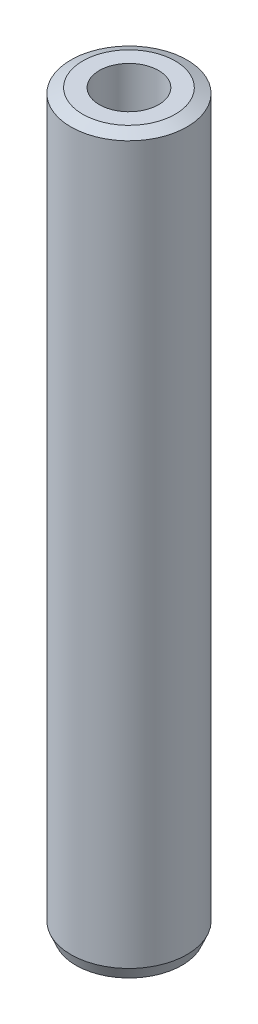
ISO-10303-21;
HEADER;
FILE_DESCRIPTION(('STEP AP214'),'2;1');
FILE_NAME('part.step','',(''),(''),'','','');
FILE_SCHEMA(('AUTOMOTIVE_DESIGN { 1 0 10303 214 1 1 1 1 }'));
ENDSEC;
DATA;
#1=APPLICATION_CONTEXT('core data for automotive mechanical design processes');
#2=APPLICATION_PROTOCOL_DEFINITION('international standard','automotive_design',2000,#1);
#3=PRODUCT_CONTEXT('',#1,'mechanical');
#4=PRODUCT('Part','Part','',(#3));
#5=PRODUCT_RELATED_PRODUCT_CATEGORY('part','',(#4));
#6=PRODUCT_DEFINITION_FORMATION('','',#4);
#7=PRODUCT_DEFINITION_CONTEXT('part definition',#1,'design');
#8=PRODUCT_DEFINITION('design','',#6,#7);
#9=PRODUCT_DEFINITION_SHAPE('','',#8);
#10=(LENGTH_UNIT() NAMED_UNIT(*) SI_UNIT(.MILLI.,.METRE.));
#11=(NAMED_UNIT(*) PLANE_ANGLE_UNIT() SI_UNIT($,.RADIAN.));
#12=(NAMED_UNIT(*) SI_UNIT($,.STERADIAN.) SOLID_ANGLE_UNIT());
#13=UNCERTAINTY_MEASURE_WITH_UNIT(LENGTH_MEASURE(1.E-05),#10,'distance_accuracy_value','');
#14=(GEOMETRIC_REPRESENTATION_CONTEXT(3) GLOBAL_UNCERTAINTY_ASSIGNED_CONTEXT((#13)) GLOBAL_UNIT_ASSIGNED_CONTEXT((#10,
#11,#12)) REPRESENTATION_CONTEXT('',''));
#15=CARTESIAN_POINT('',(0.,0.,0.));
#16=DIRECTION('',(0.,0.,1.));
#17=DIRECTION('',(1.,0.,0.));
#18=AXIS2_PLACEMENT_3D('',#15,#16,#17);
#19=CARTESIAN_POINT('',(0.,600.,0.));
#20=DIRECTION('',(0.,-1.,0.));
#21=DIRECTION('',(0.,0.,-1.));
#22=AXIS2_PLACEMENT_3D('',#19,#20,#21);
#23=CYLINDRICAL_SURFACE('',#22,47.5);
#24=CARTESIAN_POINT('',(0.,595.867776755489,0.));
#25=DIRECTION('',(0.,1.,0.));
#26=DIRECTION('',(0.,0.,1.));
#27=AXIS2_PLACEMENT_3D('',#24,#25,#26);
#28=CIRCLE('',#27,47.5);
#29=CARTESIAN_POINT('',(0.,595.867776755489,47.5));
#30=VERTEX_POINT('',#29);
#31=EDGE_CURVE('E50',#30,#30,#28,.F.);
#32=ORIENTED_EDGE('',*,*,#31,.T.);
#33=EDGE_LOOP('',(#32));
#34=FACE_BOUND('',#33,.T.);
#35=CARTESIAN_POINT('',(0.,9.68730133112805,0.));
#36=DIRECTION('',(0.,1.,0.));
#37=DIRECTION('',(0.,0.,1.));
#38=AXIS2_PLACEMENT_3D('',#35,#36,#37);
#39=CIRCLE('',#38,47.5);
#40=CARTESIAN_POINT('',(0.,9.68730133112805,47.5));
#41=VERTEX_POINT('',#40);
#42=EDGE_CURVE('E51',#41,#41,#39,.T.);
#43=ORIENTED_EDGE('',*,*,#42,.T.);
#44=EDGE_LOOP('',(#43));
#45=FACE_BOUND('',#44,.T.);
#46=ADVANCED_FACE('F39',(#34,#45),#23,.T.);
#47=CARTESIAN_POINT('',(0.,600.,0.));
#48=DIRECTION('',(0.,1.,0.));
#49=DIRECTION('',(0.,0.,1.));
#50=AXIS2_PLACEMENT_3D('',#47,#48,#49);
#51=PLANE('',#50);
#52=CARTESIAN_POINT('',(0.,600.,0.));
#53=DIRECTION('',(0.,1.,0.));
#54=DIRECTION('',(0.,0.,1.));
#55=AXIS2_PLACEMENT_3D('',#52,#53,#54);
#56=CIRCLE('',#55,37.8126986688714);
#57=CARTESIAN_POINT('',(0.,600.,37.8126986688714));
#58=VERTEX_POINT('',#57);
#59=EDGE_CURVE('E54',#58,#58,#56,.T.);
#60=ORIENTED_EDGE('',*,*,#59,.T.);
#61=EDGE_LOOP('',(#60));
#62=FACE_BOUND('',#61,.T.);
#63=CARTESIAN_POINT('',(0.,600.,0.));
#64=DIRECTION('',(0.,1.,0.));
#65=DIRECTION('',(0.,0.,1.));
#66=AXIS2_PLACEMENT_3D('',#63,#64,#65);
#67=CIRCLE('',#66,24.2454183645735);
#68=CARTESIAN_POINT('',(0.,600.,24.2454183645735));
#69=VERTEX_POINT('',#68);
#70=EDGE_CURVE('E58',#69,#69,#67,.T.);
#71=ORIENTED_EDGE('',*,*,#70,.F.);
#72=EDGE_LOOP('',(#71));
#73=FACE_BOUND('',#72,.T.);
#74=ADVANCED_FACE('F69',(#62,#73),#51,.T.);
#75=CARTESIAN_POINT('',(0.,0.,0.));
#76=DIRECTION('',(0.,1.,0.));
#77=DIRECTION('',(0.,0.,1.));
#78=AXIS2_PLACEMENT_3D('',#75,#76,#77);
#79=PLANE('',#78);
#80=CARTESIAN_POINT('',(0.,0.,0.));
#81=DIRECTION('',(0.,1.,0.));
#82=DIRECTION('',(0.,0.,1.));
#83=AXIS2_PLACEMENT_3D('',#80,#81,#82);
#84=CIRCLE('',#83,43.3677767554895);
#85=CARTESIAN_POINT('',(0.,0.,43.3677767554895));
#86=VERTEX_POINT('',#85);
#87=EDGE_CURVE('E10',#86,#86,#84,.F.);
#88=ORIENTED_EDGE('',*,*,#87,.T.);
#89=EDGE_LOOP('',(#88));
#90=FACE_BOUND('',#89,.T.);
#91=CARTESIAN_POINT('',(0.,0.,0.));
#92=DIRECTION('',(0.,1.,0.));
#93=DIRECTION('',(0.,0.,1.));
#94=AXIS2_PLACEMENT_3D('',#91,#92,#93);
#95=CIRCLE('',#94,24.2454183645735);
#96=CARTESIAN_POINT('',(0.,0.,24.2454183645735));
#97=VERTEX_POINT('',#96);
#98=EDGE_CURVE('E63',#97,#97,#95,.T.);
#99=ORIENTED_EDGE('',*,*,#98,.T.);
#100=EDGE_LOOP('',(#99));
#101=FACE_BOUND('',#100,.T.);
#102=ADVANCED_FACE('F75',(#90,#101),#79,.F.);
#103=CARTESIAN_POINT('',(0.,600.,0.));
#104=DIRECTION('',(0.,-1.,0.));
#105=DIRECTION('',(0.,0.,-1.));
#106=AXIS2_PLACEMENT_3D('',#103,#104,#105);
#107=CYLINDRICAL_SURFACE('',#106,24.2454183645735);
#108=ORIENTED_EDGE('',*,*,#70,.T.);
#109=EDGE_LOOP('',(#108));
#110=FACE_BOUND('',#109,.T.);
#111=ORIENTED_EDGE('',*,*,#98,.F.);
#112=EDGE_LOOP('',(#111));
#113=FACE_BOUND('',#112,.T.);
#114=ADVANCED_FACE('F70',(#110,#113),#107,.F.);
#115=CARTESIAN_POINT('',(0.,600.,0.));
#116=DIRECTION('',(0.,-1.,0.));
#117=DIRECTION('',(0.,0.,-1.));
#118=AXIS2_PLACEMENT_3D('',#115,#116,#117);
#119=CONICAL_SURFACE('',#118,37.8126986688714,1.16760438997708);
#120=ORIENTED_EDGE('',*,*,#31,.F.);
#121=EDGE_LOOP('',(#120));
#122=FACE_BOUND('',#121,.T.);
#123=ORIENTED_EDGE('',*,*,#59,.F.);
#124=EDGE_LOOP('',(#123));
#125=FACE_BOUND('',#124,.T.);
#126=ADVANCED_FACE('F81',(#122,#125),#119,.T.);
#127=CARTESIAN_POINT('',(0.,9.68730133112805,0.));
#128=DIRECTION('',(0.,1.,0.));
#129=DIRECTION('',(0.,0.,1.));
#130=AXIS2_PLACEMENT_3D('',#127,#128,#129);
#131=CONICAL_SURFACE('',#130,47.5,0.403191936817813);
#132=ORIENTED_EDGE('',*,*,#87,.F.);
#133=EDGE_LOOP('',(#132));
#134=FACE_BOUND('',#133,.T.);
#135=ORIENTED_EDGE('',*,*,#42,.F.);
#136=EDGE_LOOP('',(#135));
#137=FACE_BOUND('',#136,.T.);
#138=ADVANCED_FACE('F45',(#134,#137),#131,.T.);
#139=CLOSED_SHELL('',(#46,#74,#102,#114,#126,#138));
#140=MANIFOLD_SOLID_BREP('B2',#139);
#141=ADVANCED_BREP_SHAPE_REPRESENTATION('',(#18,#140),#14);
#142=SHAPE_DEFINITION_REPRESENTATION(#9,#141);
ENDSEC;
END-ISO-10303-21;
